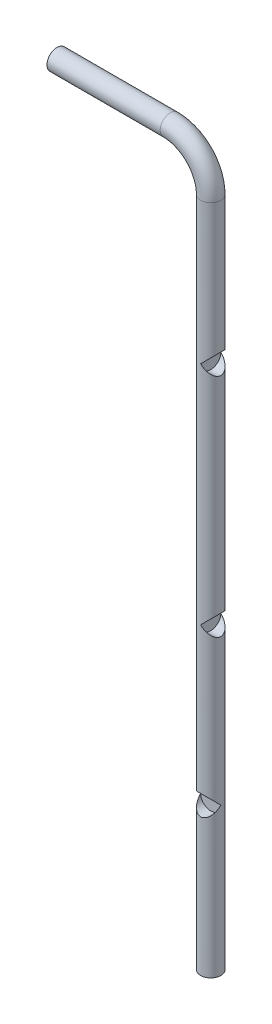
ISO-10303-21;
HEADER;
FILE_DESCRIPTION(('STEP AP214'),'2;1');
FILE_NAME('part.step','',(''),(''),'','','');
FILE_SCHEMA(('AUTOMOTIVE_DESIGN { 1 0 10303 214 1 1 1 1 }'));
ENDSEC;
DATA;
#1=APPLICATION_CONTEXT('core data for automotive mechanical design processes');
#2=APPLICATION_PROTOCOL_DEFINITION('international standard','automotive_design',2000,#1);
#3=PRODUCT_CONTEXT('',#1,'mechanical');
#4=PRODUCT('Part','Part','',(#3));
#5=PRODUCT_RELATED_PRODUCT_CATEGORY('part','',(#4));
#6=PRODUCT_DEFINITION_FORMATION('','',#4);
#7=PRODUCT_DEFINITION_CONTEXT('part definition',#1,'design');
#8=PRODUCT_DEFINITION('design','',#6,#7);
#9=PRODUCT_DEFINITION_SHAPE('','',#8);
#10=(LENGTH_UNIT() NAMED_UNIT(*) SI_UNIT(.MILLI.,.METRE.));
#11=(NAMED_UNIT(*) PLANE_ANGLE_UNIT() SI_UNIT($,.RADIAN.));
#12=(NAMED_UNIT(*) SI_UNIT($,.STERADIAN.) SOLID_ANGLE_UNIT());
#13=UNCERTAINTY_MEASURE_WITH_UNIT(LENGTH_MEASURE(1.E-05),#10,'distance_accuracy_value','');
#14=(GEOMETRIC_REPRESENTATION_CONTEXT(3) GLOBAL_UNCERTAINTY_ASSIGNED_CONTEXT((#13)) GLOBAL_UNIT_ASSIGNED_CONTEXT((#10,
#11,#12)) REPRESENTATION_CONTEXT('',''));
#15=CARTESIAN_POINT('',(0.,0.,0.));
#16=DIRECTION('',(0.,0.,1.));
#17=DIRECTION('',(1.,0.,0.));
#18=AXIS2_PLACEMENT_3D('',#15,#16,#17);
#19=CARTESIAN_POINT('',(0.,0.,0.));
#20=DIRECTION('',(0.,1.,0.));
#21=DIRECTION('',(0.,0.,1.));
#22=AXIS2_PLACEMENT_3D('',#19,#20,#21);
#23=CYLINDRICAL_SURFACE('',#22,12.5);
#24=CARTESIAN_POINT('',(0.,655.01,0.));
#25=DIRECTION('',(-0.707106781186547,0.707106781186547,0.));
#26=DIRECTION('',(0.707106781186547,0.707106781186547,0.));
#27=AXIS2_PLACEMENT_3D('',#24,#25,#26);
#28=ELLIPSE('',#27,17.6776695296637,12.5);
#29=CARTESIAN_POINT('',(0.,655.01,-12.5));
#30=VERTEX_POINT('',#29);
#31=CARTESIAN_POINT('',(0.,655.01,12.5));
#32=VERTEX_POINT('',#31);
#33=EDGE_CURVE('E93',#30,#32,#28,.F.);
#34=ORIENTED_EDGE('',*,*,#33,.F.);
#35=CARTESIAN_POINT('',(0.,655.01,0.));
#36=DIRECTION('',(0.707106781186547,0.707106781186547,0.));
#37=DIRECTION('',(-0.707106781186547,0.707106781186547,0.));
#38=AXIS2_PLACEMENT_3D('',#35,#36,#37);
#39=ELLIPSE('',#38,17.6776695296637,12.5);
#40=EDGE_CURVE('E150',#32,#30,#39,.T.);
#41=ORIENTED_EDGE('',*,*,#40,.F.);
#42=EDGE_LOOP('',(#34,#41));
#43=FACE_BOUND('',#42,.T.);
#44=CARTESIAN_POINT('',(0.,0.,0.));
#45=DIRECTION('',(0.,-1.,0.));
#46=DIRECTION('',(0.,0.,-1.));
#47=AXIS2_PLACEMENT_3D('',#44,#45,#46);
#48=CIRCLE('',#47,12.5);
#49=CARTESIAN_POINT('',(0.,0.,-12.5));
#50=VERTEX_POINT('',#49);
#51=EDGE_CURVE('E167',#50,#50,#48,.T.);
#52=ORIENTED_EDGE('',*,*,#51,.F.);
#53=EDGE_LOOP('',(#52));
#54=FACE_BOUND('',#53,.T.);
#55=CARTESIAN_POINT('',(0.,830.,0.));
#56=DIRECTION('',(0.,-1.,0.));
#57=DIRECTION('',(0.,0.,-1.));
#58=AXIS2_PLACEMENT_3D('',#55,#56,#57);
#59=CIRCLE('',#58,12.5);
#60=CARTESIAN_POINT('',(12.5000000000002,830.,0.));
#61=VERTEX_POINT('',#60);
#62=EDGE_CURVE('E143',#61,#61,#59,.T.);
#63=ORIENTED_EDGE('',*,*,#62,.T.);
#64=EDGE_LOOP('',(#63));
#65=FACE_BOUND('',#64,.T.);
#66=CARTESIAN_POINT('',(0.,375.5,0.));
#67=DIRECTION('',(-0.707106781186547,0.707106781186547,0.));
#68=DIRECTION('',(0.707106781186547,0.707106781186547,0.));
#69=AXIS2_PLACEMENT_3D('',#66,#67,#68);
#70=ELLIPSE('',#69,17.6776695296637,12.5);
#71=CARTESIAN_POINT('',(0.,375.5,-12.5));
#72=VERTEX_POINT('',#71);
#73=CARTESIAN_POINT('',(0.,375.5,12.5));
#74=VERTEX_POINT('',#73);
#75=EDGE_CURVE('E140',#72,#74,#70,.F.);
#76=ORIENTED_EDGE('',*,*,#75,.F.);
#77=CARTESIAN_POINT('',(0.,375.5,0.));
#78=DIRECTION('',(0.707106781186547,0.707106781186547,0.));
#79=DIRECTION('',(-0.707106781186547,0.707106781186547,0.));
#80=AXIS2_PLACEMENT_3D('',#77,#78,#79);
#81=ELLIPSE('',#80,17.6776695296637,12.5);
#82=EDGE_CURVE('E135',#74,#72,#81,.T.);
#83=ORIENTED_EDGE('',*,*,#82,.F.);
#84=EDGE_LOOP('',(#76,#83));
#85=FACE_BOUND('',#84,.T.);
#86=CARTESIAN_POINT('',(0.,182.5,0.));
#87=DIRECTION('',(0.,0.707106781186547,-0.707106781186547));
#88=DIRECTION('',(0.,0.707106781186547,0.707106781186547));
#89=AXIS2_PLACEMENT_3D('',#86,#87,#88);
#90=ELLIPSE('',#89,17.6776695296637,12.5);
#91=CARTESIAN_POINT('',(12.5,182.5,0.));
#92=VERTEX_POINT('',#91);
#93=CARTESIAN_POINT('',(-12.5,182.5,0.));
#94=VERTEX_POINT('',#93);
#95=EDGE_CURVE('E12',#92,#94,#90,.F.);
#96=ORIENTED_EDGE('',*,*,#95,.F.);
#97=CARTESIAN_POINT('',(0.,182.5,0.));
#98=DIRECTION('',(0.,0.707106781186547,0.707106781186547));
#99=DIRECTION('',(0.,0.707106781186547,-0.707106781186547));
#100=AXIS2_PLACEMENT_3D('',#97,#98,#99);
#101=ELLIPSE('',#100,17.6776695296637,12.5);
#102=EDGE_CURVE('E60',#94,#92,#101,.T.);
#103=ORIENTED_EDGE('',*,*,#102,.F.);
#104=EDGE_LOOP('',(#96,#103));
#105=FACE_BOUND('',#104,.T.);
#106=ADVANCED_FACE('F51',(#43,#54,#65,#85,#105),#23,.T.);
#107=CARTESIAN_POINT('',(0.,0.,0.));
#108=DIRECTION('',(0.,-1.,0.));
#109=DIRECTION('',(0.,0.,-1.));
#110=AXIS2_PLACEMENT_3D('',#107,#108,#109);
#111=PLANE('',#110);
#112=ORIENTED_EDGE('',*,*,#51,.T.);
#113=EDGE_LOOP('',(#112));
#114=FACE_BOUND('',#113,.T.);
#115=ADVANCED_FACE('F53',(#114),#111,.T.);
#116=CARTESIAN_POINT('',(-190.,880.,0.));
#117=DIRECTION('',(1.,0.,0.));
#118=DIRECTION('',(0.,0.,-1.));
#119=AXIS2_PLACEMENT_3D('',#116,#117,#118);
#120=PLANE('',#119);
#121=CARTESIAN_POINT('',(-190.,880.,0.));
#122=DIRECTION('',(1.,0.,0.));
#123=DIRECTION('',(0.,0.,-1.));
#124=AXIS2_PLACEMENT_3D('',#121,#122,#123);
#125=CIRCLE('',#124,12.5);
#126=CARTESIAN_POINT('',(-190.,880.,-12.5));
#127=VERTEX_POINT('',#126);
#128=EDGE_CURVE('E133',#127,#127,#125,.T.);
#129=ORIENTED_EDGE('',*,*,#128,.F.);
#130=EDGE_LOOP('',(#129));
#131=FACE_BOUND('',#130,.T.);
#132=ADVANCED_FACE('F108',(#131),#120,.F.);
#133=CARTESIAN_POINT('',(-50.,830.,0.));
#134=DIRECTION('',(0.,0.,1.));
#135=DIRECTION('',(1.,0.,0.));
#136=AXIS2_PLACEMENT_3D('',#133,#134,#135);
#137=TOROIDAL_SURFACE('',#136,50.0000000000002,12.5);
#138=CARTESIAN_POINT('',(-50.0000000000012,880.,0.));
#139=DIRECTION('',(1.,0.,0.));
#140=DIRECTION('',(0.,0.,-1.));
#141=AXIS2_PLACEMENT_3D('',#138,#139,#140);
#142=CIRCLE('',#141,12.5);
#143=CARTESIAN_POINT('',(-50.0000000000014,892.5,0.));
#144=VERTEX_POINT('',#143);
#145=EDGE_CURVE('E136',#144,#144,#142,.T.);
#146=CARTESIAN_POINT('',(-50.,830.,0.));
#147=DIRECTION('',(0.,0.,1.));
#148=DIRECTION('',(1.,0.,0.));
#149=AXIS2_PLACEMENT_3D('',#146,#147,#148);
#150=CIRCLE('',#149,62.5000000000002);
#151=EDGE_CURVE('',#61,#144,#150,.T.);
#152=ORIENTED_EDGE('',*,*,#62,.F.);
#153=ORIENTED_EDGE('',*,*,#145,.T.);
#154=ORIENTED_EDGE('',*,*,#151,.T.);
#155=ORIENTED_EDGE('',*,*,#151,.F.);
#156=EDGE_LOOP('',(#152,#154,#153,#155));
#157=FACE_BOUND('',#156,.T.);
#158=ADVANCED_FACE('F116',(#157),#137,.T.);
#159=CARTESIAN_POINT('',(-50.,880.,0.));
#160=DIRECTION('',(-1.,0.,0.));
#161=DIRECTION('',(0.,-1.,0.));
#162=AXIS2_PLACEMENT_3D('',#159,#160,#161);
#163=CYLINDRICAL_SURFACE('',#162,12.5);
#164=ORIENTED_EDGE('',*,*,#128,.T.);
#165=EDGE_LOOP('',(#164));
#166=FACE_BOUND('',#165,.T.);
#167=ORIENTED_EDGE('',*,*,#145,.F.);
#168=EDGE_LOOP('',(#167));
#169=FACE_BOUND('',#168,.T.);
#170=ADVANCED_FACE('F104',(#166,#169),#163,.T.);
#171=CARTESIAN_POINT('',(21.,375.5,0.));
#172=DIRECTION('',(-1.,0.,0.));
#173=DIRECTION('',(0.,0.,1.));
#174=AXIS2_PLACEMENT_3D('',#171,#172,#173);
#175=CYLINDRICAL_SURFACE('',#174,12.5);
#176=ORIENTED_EDGE('',*,*,#75,.T.);
#177=CARTESIAN_POINT('',(0.,375.5,0.));
#178=DIRECTION('',(1.,0.,0.));
#179=DIRECTION('',(0.,0.,-1.));
#180=AXIS2_PLACEMENT_3D('',#177,#178,#179);
#181=CIRCLE('',#180,12.5);
#182=EDGE_CURVE('E163',#72,#74,#181,.T.);
#183=ORIENTED_EDGE('',*,*,#182,.F.);
#184=EDGE_LOOP('',(#176,#183));
#185=FACE_BOUND('',#184,.T.);
#186=ADVANCED_FACE('F110',(#185),#175,.F.);
#187=ORIENTED_EDGE('',*,*,#82,.T.);
#188=EDGE_CURVE('E100',#74,#72,#181,.T.);
#189=ORIENTED_EDGE('',*,*,#188,.F.);
#190=EDGE_LOOP('',(#187,#189));
#191=FACE_BOUND('',#190,.T.);
#192=ADVANCED_FACE('F123',(#191),#175,.F.);
#193=CARTESIAN_POINT('',(0.,375.5,0.));
#194=DIRECTION('',(1.,0.,0.));
#195=DIRECTION('',(0.,0.,-1.));
#196=AXIS2_PLACEMENT_3D('',#193,#194,#195);
#197=PLANE('',#196);
#198=ORIENTED_EDGE('',*,*,#182,.T.);
#199=ORIENTED_EDGE('',*,*,#188,.T.);
#200=EDGE_LOOP('',(#198,#199));
#201=FACE_BOUND('',#200,.T.);
#202=ADVANCED_FACE('F184',(#201),#197,.T.);
#203=CARTESIAN_POINT('',(21.,655.01,0.));
#204=DIRECTION('',(-1.,0.,0.));
#205=DIRECTION('',(0.,0.,1.));
#206=AXIS2_PLACEMENT_3D('',#203,#204,#205);
#207=CYLINDRICAL_SURFACE('',#206,12.5);
#208=ORIENTED_EDGE('',*,*,#33,.T.);
#209=CARTESIAN_POINT('',(0.,655.01,0.));
#210=DIRECTION('',(1.,0.,0.));
#211=DIRECTION('',(0.,0.,-1.));
#212=AXIS2_PLACEMENT_3D('',#209,#210,#211);
#213=CIRCLE('',#212,12.5);
#214=EDGE_CURVE('E73',#30,#32,#213,.T.);
#215=ORIENTED_EDGE('',*,*,#214,.F.);
#216=EDGE_LOOP('',(#208,#215));
#217=FACE_BOUND('',#216,.T.);
#218=ADVANCED_FACE('F157',(#217),#207,.F.);
#219=ORIENTED_EDGE('',*,*,#40,.T.);
#220=EDGE_CURVE('E160',#32,#30,#213,.T.);
#221=ORIENTED_EDGE('',*,*,#220,.F.);
#222=EDGE_LOOP('',(#219,#221));
#223=FACE_BOUND('',#222,.T.);
#224=ADVANCED_FACE('F159',(#223),#207,.F.);
#225=CARTESIAN_POINT('',(0.,655.01,0.));
#226=DIRECTION('',(1.,0.,0.));
#227=DIRECTION('',(0.,0.,-1.));
#228=AXIS2_PLACEMENT_3D('',#225,#226,#227);
#229=PLANE('',#228);
#230=ORIENTED_EDGE('',*,*,#214,.T.);
#231=ORIENTED_EDGE('',*,*,#220,.T.);
#232=EDGE_LOOP('',(#230,#231));
#233=FACE_BOUND('',#232,.T.);
#234=ADVANCED_FACE('F161',(#233),#229,.T.);
#235=CARTESIAN_POINT('',(0.,182.5,13.));
#236=DIRECTION('',(0.,0.,-1.));
#237=DIRECTION('',(-1.,0.,0.));
#238=AXIS2_PLACEMENT_3D('',#235,#236,#237);
#239=CYLINDRICAL_SURFACE('',#238,12.5);
#240=ORIENTED_EDGE('',*,*,#95,.T.);
#241=CARTESIAN_POINT('',(0.,182.5,0.));
#242=DIRECTION('',(0.,0.,1.));
#243=DIRECTION('',(1.,0.,0.));
#244=AXIS2_PLACEMENT_3D('',#241,#242,#243);
#245=CIRCLE('',#244,12.5);
#246=EDGE_CURVE('E66',#92,#94,#245,.T.);
#247=ORIENTED_EDGE('',*,*,#246,.F.);
#248=EDGE_LOOP('',(#240,#247));
#249=FACE_BOUND('',#248,.T.);
#250=ADVANCED_FACE('F98',(#249),#239,.F.);
#251=ORIENTED_EDGE('',*,*,#102,.T.);
#252=EDGE_CURVE('E89',#94,#92,#245,.T.);
#253=ORIENTED_EDGE('',*,*,#252,.F.);
#254=EDGE_LOOP('',(#251,#253));
#255=FACE_BOUND('',#254,.T.);
#256=ADVANCED_FACE('F88',(#255),#239,.F.);
#257=CARTESIAN_POINT('',(0.,182.5,0.));
#258=DIRECTION('',(0.,0.,1.));
#259=DIRECTION('',(1.,0.,0.));
#260=AXIS2_PLACEMENT_3D('',#257,#258,#259);
#261=PLANE('',#260);
#262=ORIENTED_EDGE('',*,*,#246,.T.);
#263=ORIENTED_EDGE('',*,*,#252,.T.);
#264=EDGE_LOOP('',(#262,#263));
#265=FACE_BOUND('',#264,.T.);
#266=ADVANCED_FACE('F94',(#265),#261,.T.);
#267=CLOSED_SHELL('',(#106,#115,#132,#158,#170,#186,#192,#202,#218,#224,#234,#250,#256,#266));
#268=MANIFOLD_SOLID_BREP('B2',#267);
#269=ADVANCED_BREP_SHAPE_REPRESENTATION('',(#18,#268),#14);
#270=SHAPE_DEFINITION_REPRESENTATION(#9,#269);
ENDSEC;
END-ISO-10303-21;
